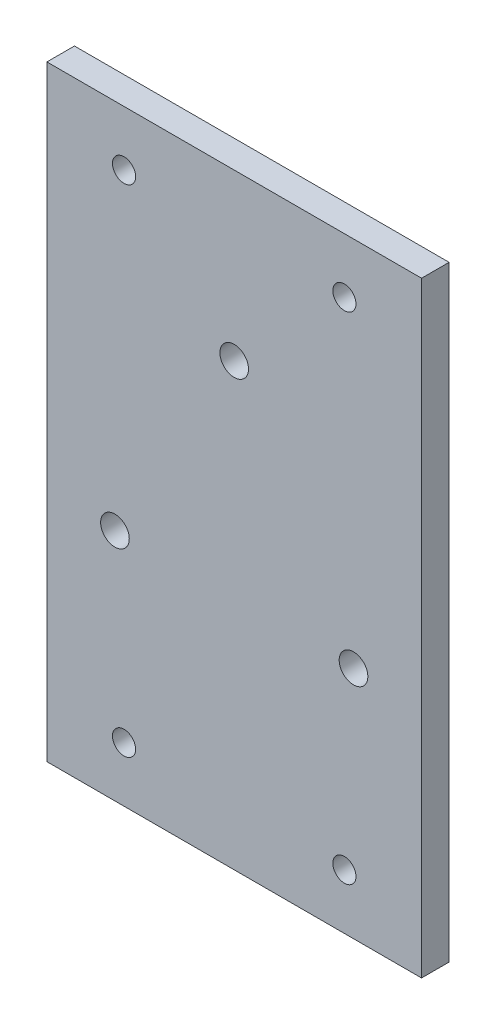
ISO-10303-21;
HEADER;
FILE_DESCRIPTION(('STEP AP214'),'2;1');
FILE_NAME('part.step','',(''),(''),'','','');
FILE_SCHEMA(('AUTOMOTIVE_DESIGN { 1 0 10303 214 1 1 1 1 }'));
ENDSEC;
DATA;
#1=APPLICATION_CONTEXT('core data for automotive mechanical design processes');
#2=APPLICATION_PROTOCOL_DEFINITION('international standard','automotive_design',2000,#1);
#3=PRODUCT_CONTEXT('',#1,'mechanical');
#4=PRODUCT('Part','Part','',(#3));
#5=PRODUCT_RELATED_PRODUCT_CATEGORY('part','',(#4));
#6=PRODUCT_DEFINITION_FORMATION('','',#4);
#7=PRODUCT_DEFINITION_CONTEXT('part definition',#1,'design');
#8=PRODUCT_DEFINITION('design','',#6,#7);
#9=PRODUCT_DEFINITION_SHAPE('','',#8);
#10=(LENGTH_UNIT() NAMED_UNIT(*) SI_UNIT(.MILLI.,.METRE.));
#11=(NAMED_UNIT(*) PLANE_ANGLE_UNIT() SI_UNIT($,.RADIAN.));
#12=(NAMED_UNIT(*) SI_UNIT($,.STERADIAN.) SOLID_ANGLE_UNIT());
#13=UNCERTAINTY_MEASURE_WITH_UNIT(LENGTH_MEASURE(1.E-05),#10,'distance_accuracy_value','');
#14=(GEOMETRIC_REPRESENTATION_CONTEXT(3) GLOBAL_UNCERTAINTY_ASSIGNED_CONTEXT((#13)) GLOBAL_UNIT_ASSIGNED_CONTEXT((#10,
#11,#12)) REPRESENTATION_CONTEXT('',''));
#15=CARTESIAN_POINT('',(0.,0.,0.));
#16=DIRECTION('',(0.,0.,1.));
#17=DIRECTION('',(1.,0.,0.));
#18=AXIS2_PLACEMENT_3D('',#15,#16,#17);
#19=CARTESIAN_POINT('',(0.,0.,5.));
#20=DIRECTION('',(0.,0.,1.));
#21=DIRECTION('',(1.,0.,0.));
#22=AXIS2_PLACEMENT_3D('',#19,#20,#21);
#23=PLANE('',#22);
#24=CARTESIAN_POINT('',(0.,25.,5.));
#25=DIRECTION('',(0.,0.,1.));
#26=DIRECTION('',(1.,0.,0.));
#27=AXIS2_PLACEMENT_3D('',#24,#25,#26);
#28=CIRCLE('',#27,2.6);
#29=CARTESIAN_POINT('',(2.59999999999999,25.,5.));
#30=VERTEX_POINT('',#29);
#31=EDGE_CURVE('E139',#30,#30,#28,.T.);
#32=ORIENTED_EDGE('',*,*,#31,.F.);
#33=EDGE_LOOP('',(#32));
#34=FACE_BOUND('',#33,.T.);
#35=CARTESIAN_POINT('',(-20.,-45.,5.));
#36=DIRECTION('',(0.,0.,1.));
#37=DIRECTION('',(1.,0.,0.));
#38=AXIS2_PLACEMENT_3D('',#35,#36,#37);
#39=CIRCLE('',#38,2.1);
#40=CARTESIAN_POINT('',(-17.9,-45.,5.));
#41=VERTEX_POINT('',#40);
#42=EDGE_CURVE('E127',#41,#41,#39,.T.);
#43=ORIENTED_EDGE('',*,*,#42,.F.);
#44=EDGE_LOOP('',(#43));
#45=FACE_BOUND('',#44,.T.);
#46=CARTESIAN_POINT('',(-20.,45.,5.));
#47=DIRECTION('',(0.,0.,1.));
#48=DIRECTION('',(1.,0.,0.));
#49=AXIS2_PLACEMENT_3D('',#46,#47,#48);
#50=CIRCLE('',#49,2.1);
#51=CARTESIAN_POINT('',(-17.9,45.,5.));
#52=VERTEX_POINT('',#51);
#53=EDGE_CURVE('E115',#52,#52,#50,.T.);
#54=ORIENTED_EDGE('',*,*,#53,.F.);
#55=EDGE_LOOP('',(#54));
#56=FACE_BOUND('',#55,.T.);
#57=DIRECTION('',(0.,1.,0.));
#58=VECTOR('',#57,1.);
#59=CARTESIAN_POINT('',(34.,55.,5.));
#60=LINE('',#59,#58);
#61=CARTESIAN_POINT('',(34.,-55.,5.));
#62=VERTEX_POINT('',#61);
#63=CARTESIAN_POINT('',(34.,55.,5.));
#64=VERTEX_POINT('',#63);
#65=EDGE_CURVE('E85',#62,#64,#60,.T.);
#66=ORIENTED_EDGE('',*,*,#65,.T.);
#67=DIRECTION('',(-1.,0.,0.));
#68=VECTOR('',#67,1.);
#69=CARTESIAN_POINT('',(-34.,55.,5.));
#70=LINE('',#69,#68);
#71=CARTESIAN_POINT('',(-34.,55.,5.));
#72=VERTEX_POINT('',#71);
#73=EDGE_CURVE('E80',#64,#72,#70,.T.);
#74=ORIENTED_EDGE('',*,*,#73,.T.);
#75=DIRECTION('',(0.,-1.,0.));
#76=VECTOR('',#75,1.);
#77=CARTESIAN_POINT('',(-34.,55.,5.));
#78=LINE('',#77,#76);
#79=CARTESIAN_POINT('',(-34.,-55.,5.));
#80=VERTEX_POINT('',#79);
#81=EDGE_CURVE('E83',#72,#80,#78,.T.);
#82=ORIENTED_EDGE('',*,*,#81,.T.);
#83=DIRECTION('',(1.,0.,0.));
#84=VECTOR('',#83,1.);
#85=CARTESIAN_POINT('',(-34.,-55.,5.));
#86=LINE('',#85,#84);
#87=EDGE_CURVE('E50',#80,#62,#86,.T.);
#88=ORIENTED_EDGE('',*,*,#87,.T.);
#89=EDGE_LOOP('',(#66,#74,#82,#88));
#90=FACE_BOUND('',#89,.T.);
#91=CARTESIAN_POINT('',(20.,45.,5.));
#92=DIRECTION('',(0.,0.,1.));
#93=DIRECTION('',(1.,0.,0.));
#94=AXIS2_PLACEMENT_3D('',#91,#92,#93);
#95=CIRCLE('',#94,2.1);
#96=CARTESIAN_POINT('',(22.1,45.,5.));
#97=VERTEX_POINT('',#96);
#98=EDGE_CURVE('E100',#97,#97,#95,.T.);
#99=ORIENTED_EDGE('',*,*,#98,.F.);
#100=EDGE_LOOP('',(#99));
#101=FACE_BOUND('',#100,.T.);
#102=CARTESIAN_POINT('',(20.,-45.,5.));
#103=DIRECTION('',(0.,0.,1.));
#104=DIRECTION('',(1.,0.,0.));
#105=AXIS2_PLACEMENT_3D('',#102,#103,#104);
#106=CIRCLE('',#105,2.1);
#107=CARTESIAN_POINT('',(22.1,-45.,5.));
#108=VERTEX_POINT('',#107);
#109=EDGE_CURVE('E121',#108,#108,#106,.T.);
#110=ORIENTED_EDGE('',*,*,#109,.F.);
#111=EDGE_LOOP('',(#110));
#112=FACE_BOUND('',#111,.T.);
#113=CARTESIAN_POINT('',(21.650635094611,-12.5,5.));
#114=DIRECTION('',(0.,0.,1.));
#115=DIRECTION('',(1.,0.,0.));
#116=AXIS2_PLACEMENT_3D('',#113,#114,#115);
#117=CIRCLE('',#116,2.6);
#118=CARTESIAN_POINT('',(24.250635094611,-12.5,5.));
#119=VERTEX_POINT('',#118);
#120=EDGE_CURVE('E133',#119,#119,#117,.T.);
#121=ORIENTED_EDGE('',*,*,#120,.F.);
#122=EDGE_LOOP('',(#121));
#123=FACE_BOUND('',#122,.T.);
#124=CARTESIAN_POINT('',(-21.650635094611,-12.5,5.));
#125=DIRECTION('',(0.,0.,1.));
#126=DIRECTION('',(1.,0.,0.));
#127=AXIS2_PLACEMENT_3D('',#124,#125,#126);
#128=CIRCLE('',#127,2.6);
#129=CARTESIAN_POINT('',(-19.050635094611,-12.5,5.));
#130=VERTEX_POINT('',#129);
#131=EDGE_CURVE('E145',#130,#130,#128,.T.);
#132=ORIENTED_EDGE('',*,*,#131,.F.);
#133=EDGE_LOOP('',(#132));
#134=FACE_BOUND('',#133,.T.);
#135=ADVANCED_FACE('F33',(#34,#45,#56,#90,#101,#112,#123,#134),#23,.T.);
#136=CARTESIAN_POINT('',(0.,0.,0.));
#137=DIRECTION('',(0.,0.,1.));
#138=DIRECTION('',(1.,0.,0.));
#139=AXIS2_PLACEMENT_3D('',#136,#137,#138);
#140=PLANE('',#139);
#141=DIRECTION('',(0.,1.,0.));
#142=VECTOR('',#141,1.);
#143=CARTESIAN_POINT('',(34.,55.,0.));
#144=LINE('',#143,#142);
#145=CARTESIAN_POINT('',(34.,-55.,0.));
#146=VERTEX_POINT('',#145);
#147=CARTESIAN_POINT('',(34.,55.,0.));
#148=VERTEX_POINT('',#147);
#149=EDGE_CURVE('E97',#146,#148,#144,.T.);
#150=ORIENTED_EDGE('',*,*,#149,.F.);
#151=DIRECTION('',(1.,0.,0.));
#152=VECTOR('',#151,1.);
#153=CARTESIAN_POINT('',(-34.,-55.,0.));
#154=LINE('',#153,#152);
#155=CARTESIAN_POINT('',(-34.,-55.,0.));
#156=VERTEX_POINT('',#155);
#157=EDGE_CURVE('E73',#156,#146,#154,.T.);
#158=ORIENTED_EDGE('',*,*,#157,.F.);
#159=DIRECTION('',(0.,-1.,0.));
#160=VECTOR('',#159,1.);
#161=CARTESIAN_POINT('',(-34.,55.,0.));
#162=LINE('',#161,#160);
#163=CARTESIAN_POINT('',(-34.,55.,0.));
#164=VERTEX_POINT('',#163);
#165=EDGE_CURVE('E67',#164,#156,#162,.T.);
#166=ORIENTED_EDGE('',*,*,#165,.F.);
#167=DIRECTION('',(-1.,0.,0.));
#168=VECTOR('',#167,1.);
#169=CARTESIAN_POINT('',(-34.,55.,0.));
#170=LINE('',#169,#168);
#171=EDGE_CURVE('E89',#148,#164,#170,.T.);
#172=ORIENTED_EDGE('',*,*,#171,.F.);
#173=EDGE_LOOP('',(#150,#158,#166,#172));
#174=FACE_BOUND('',#173,.T.);
#175=CARTESIAN_POINT('',(20.,45.,0.));
#176=DIRECTION('',(0.,0.,1.));
#177=DIRECTION('',(1.,0.,0.));
#178=AXIS2_PLACEMENT_3D('',#175,#176,#177);
#179=CIRCLE('',#178,2.1);
#180=CARTESIAN_POINT('',(22.1,45.,0.));
#181=VERTEX_POINT('',#180);
#182=EDGE_CURVE('E112',#181,#181,#179,.T.);
#183=ORIENTED_EDGE('',*,*,#182,.T.);
#184=EDGE_LOOP('',(#183));
#185=FACE_BOUND('',#184,.T.);
#186=CARTESIAN_POINT('',(-20.,45.,0.));
#187=DIRECTION('',(0.,0.,1.));
#188=DIRECTION('',(1.,0.,0.));
#189=AXIS2_PLACEMENT_3D('',#186,#187,#188);
#190=CIRCLE('',#189,2.1);
#191=CARTESIAN_POINT('',(-17.9,45.,0.));
#192=VERTEX_POINT('',#191);
#193=EDGE_CURVE('E118',#192,#192,#190,.T.);
#194=ORIENTED_EDGE('',*,*,#193,.T.);
#195=EDGE_LOOP('',(#194));
#196=FACE_BOUND('',#195,.T.);
#197=CARTESIAN_POINT('',(20.,-45.,0.));
#198=DIRECTION('',(0.,0.,1.));
#199=DIRECTION('',(1.,0.,0.));
#200=AXIS2_PLACEMENT_3D('',#197,#198,#199);
#201=CIRCLE('',#200,2.1);
#202=CARTESIAN_POINT('',(22.1,-45.,0.));
#203=VERTEX_POINT('',#202);
#204=EDGE_CURVE('E124',#203,#203,#201,.T.);
#205=ORIENTED_EDGE('',*,*,#204,.T.);
#206=EDGE_LOOP('',(#205));
#207=FACE_BOUND('',#206,.T.);
#208=CARTESIAN_POINT('',(-20.,-45.,0.));
#209=DIRECTION('',(0.,0.,1.));
#210=DIRECTION('',(1.,0.,0.));
#211=AXIS2_PLACEMENT_3D('',#208,#209,#210);
#212=CIRCLE('',#211,2.1);
#213=CARTESIAN_POINT('',(-17.9,-45.,0.));
#214=VERTEX_POINT('',#213);
#215=EDGE_CURVE('E130',#214,#214,#212,.T.);
#216=ORIENTED_EDGE('',*,*,#215,.T.);
#217=EDGE_LOOP('',(#216));
#218=FACE_BOUND('',#217,.T.);
#219=CARTESIAN_POINT('',(21.650635094611,-12.5,0.));
#220=DIRECTION('',(0.,0.,1.));
#221=DIRECTION('',(1.,0.,0.));
#222=AXIS2_PLACEMENT_3D('',#219,#220,#221);
#223=CIRCLE('',#222,2.6);
#224=CARTESIAN_POINT('',(24.250635094611,-12.5,0.));
#225=VERTEX_POINT('',#224);
#226=EDGE_CURVE('E136',#225,#225,#223,.T.);
#227=ORIENTED_EDGE('',*,*,#226,.T.);
#228=EDGE_LOOP('',(#227));
#229=FACE_BOUND('',#228,.T.);
#230=CARTESIAN_POINT('',(0.,25.,0.));
#231=DIRECTION('',(0.,0.,1.));
#232=DIRECTION('',(1.,0.,0.));
#233=AXIS2_PLACEMENT_3D('',#230,#231,#232);
#234=CIRCLE('',#233,2.6);
#235=CARTESIAN_POINT('',(2.59999999999999,25.,0.));
#236=VERTEX_POINT('',#235);
#237=EDGE_CURVE('E142',#236,#236,#234,.T.);
#238=ORIENTED_EDGE('',*,*,#237,.T.);
#239=EDGE_LOOP('',(#238));
#240=FACE_BOUND('',#239,.T.);
#241=CARTESIAN_POINT('',(-21.650635094611,-12.5,0.));
#242=DIRECTION('',(0.,0.,1.));
#243=DIRECTION('',(1.,0.,0.));
#244=AXIS2_PLACEMENT_3D('',#241,#242,#243);
#245=CIRCLE('',#244,2.6);
#246=CARTESIAN_POINT('',(-19.050635094611,-12.5,0.));
#247=VERTEX_POINT('',#246);
#248=EDGE_CURVE('E148',#247,#247,#245,.T.);
#249=ORIENTED_EDGE('',*,*,#248,.T.);
#250=EDGE_LOOP('',(#249));
#251=FACE_BOUND('',#250,.T.);
#252=ADVANCED_FACE('F108',(#174,#185,#196,#207,#218,#229,#240,#251),#140,.F.);
#253=CARTESIAN_POINT('',(34.,55.,5.));
#254=DIRECTION('',(-1.,0.,0.));
#255=DIRECTION('',(0.,-1.,0.));
#256=AXIS2_PLACEMENT_3D('',#253,#254,#255);
#257=PLANE('',#256);
#258=ORIENTED_EDGE('',*,*,#149,.T.);
#259=DIRECTION('',(0.,0.,-1.));
#260=VECTOR('',#259,1.);
#261=CARTESIAN_POINT('',(34.,55.,5.));
#262=LINE('',#261,#260);
#263=EDGE_CURVE('E11',#64,#148,#262,.T.);
#264=ORIENTED_EDGE('',*,*,#263,.F.);
#265=ORIENTED_EDGE('',*,*,#65,.F.);
#266=DIRECTION('',(0.,0.,-1.));
#267=VECTOR('',#266,1.);
#268=CARTESIAN_POINT('',(34.,-55.,5.));
#269=LINE('',#268,#267);
#270=EDGE_CURVE('E93',#62,#146,#269,.T.);
#271=ORIENTED_EDGE('',*,*,#270,.T.);
#272=EDGE_LOOP('',(#258,#264,#265,#271));
#273=FACE_BOUND('',#272,.T.);
#274=ADVANCED_FACE('F35',(#273),#257,.F.);
#275=CARTESIAN_POINT('',(-34.,55.,5.));
#276=DIRECTION('',(0.,-1.,0.));
#277=DIRECTION('',(0.,0.,-1.));
#278=AXIS2_PLACEMENT_3D('',#275,#276,#277);
#279=PLANE('',#278);
#280=ORIENTED_EDGE('',*,*,#171,.T.);
#281=DIRECTION('',(0.,0.,-1.));
#282=VECTOR('',#281,1.);
#283=CARTESIAN_POINT('',(-34.,55.,5.));
#284=LINE('',#283,#282);
#285=EDGE_CURVE('E42',#72,#164,#284,.T.);
#286=ORIENTED_EDGE('',*,*,#285,.F.);
#287=ORIENTED_EDGE('',*,*,#73,.F.);
#288=ORIENTED_EDGE('',*,*,#263,.T.);
#289=EDGE_LOOP('',(#280,#286,#287,#288));
#290=FACE_BOUND('',#289,.T.);
#291=ADVANCED_FACE('F88',(#290),#279,.F.);
#292=CARTESIAN_POINT('',(-34.,55.,5.));
#293=DIRECTION('',(1.,0.,0.));
#294=DIRECTION('',(0.,1.,0.));
#295=AXIS2_PLACEMENT_3D('',#292,#293,#294);
#296=PLANE('',#295);
#297=ORIENTED_EDGE('',*,*,#165,.T.);
#298=DIRECTION('',(0.,0.,-1.));
#299=VECTOR('',#298,1.);
#300=CARTESIAN_POINT('',(-34.,-55.,5.));
#301=LINE('',#300,#299);
#302=EDGE_CURVE('E90',#80,#156,#301,.T.);
#303=ORIENTED_EDGE('',*,*,#302,.F.);
#304=ORIENTED_EDGE('',*,*,#81,.F.);
#305=ORIENTED_EDGE('',*,*,#285,.T.);
#306=EDGE_LOOP('',(#297,#303,#304,#305));
#307=FACE_BOUND('',#306,.T.);
#308=ADVANCED_FACE('F91',(#307),#296,.F.);
#309=CARTESIAN_POINT('',(-34.,-55.,5.));
#310=DIRECTION('',(0.,1.,0.));
#311=DIRECTION('',(0.,0.,1.));
#312=AXIS2_PLACEMENT_3D('',#309,#310,#311);
#313=PLANE('',#312);
#314=ORIENTED_EDGE('',*,*,#157,.T.);
#315=ORIENTED_EDGE('',*,*,#270,.F.);
#316=ORIENTED_EDGE('',*,*,#87,.F.);
#317=ORIENTED_EDGE('',*,*,#302,.T.);
#318=EDGE_LOOP('',(#314,#315,#316,#317));
#319=FACE_BOUND('',#318,.T.);
#320=ADVANCED_FACE('F105',(#319),#313,.F.);
#321=CARTESIAN_POINT('',(20.,45.,5.));
#322=DIRECTION('',(0.,0.,-1.));
#323=DIRECTION('',(-1.,0.,0.));
#324=AXIS2_PLACEMENT_3D('',#321,#322,#323);
#325=CYLINDRICAL_SURFACE('',#324,2.1);
#326=ORIENTED_EDGE('',*,*,#98,.T.);
#327=EDGE_LOOP('',(#326));
#328=FACE_BOUND('',#327,.T.);
#329=ORIENTED_EDGE('',*,*,#182,.F.);
#330=EDGE_LOOP('',(#329));
#331=FACE_BOUND('',#330,.T.);
#332=ADVANCED_FACE('F167',(#328,#331),#325,.F.);
#333=CARTESIAN_POINT('',(-20.,45.,5.));
#334=DIRECTION('',(0.,0.,-1.));
#335=DIRECTION('',(-1.,0.,0.));
#336=AXIS2_PLACEMENT_3D('',#333,#334,#335);
#337=CYLINDRICAL_SURFACE('',#336,2.1);
#338=ORIENTED_EDGE('',*,*,#53,.T.);
#339=EDGE_LOOP('',(#338));
#340=FACE_BOUND('',#339,.T.);
#341=ORIENTED_EDGE('',*,*,#193,.F.);
#342=EDGE_LOOP('',(#341));
#343=FACE_BOUND('',#342,.T.);
#344=ADVANCED_FACE('F213',(#340,#343),#337,.F.);
#345=CARTESIAN_POINT('',(20.,-45.,5.));
#346=DIRECTION('',(0.,0.,-1.));
#347=DIRECTION('',(-1.,0.,0.));
#348=AXIS2_PLACEMENT_3D('',#345,#346,#347);
#349=CYLINDRICAL_SURFACE('',#348,2.1);
#350=ORIENTED_EDGE('',*,*,#109,.T.);
#351=EDGE_LOOP('',(#350));
#352=FACE_BOUND('',#351,.T.);
#353=ORIENTED_EDGE('',*,*,#204,.F.);
#354=EDGE_LOOP('',(#353));
#355=FACE_BOUND('',#354,.T.);
#356=ADVANCED_FACE('F221',(#352,#355),#349,.F.);
#357=CARTESIAN_POINT('',(-20.,-45.,5.));
#358=DIRECTION('',(0.,0.,-1.));
#359=DIRECTION('',(-1.,0.,0.));
#360=AXIS2_PLACEMENT_3D('',#357,#358,#359);
#361=CYLINDRICAL_SURFACE('',#360,2.1);
#362=ORIENTED_EDGE('',*,*,#42,.T.);
#363=EDGE_LOOP('',(#362));
#364=FACE_BOUND('',#363,.T.);
#365=ORIENTED_EDGE('',*,*,#215,.F.);
#366=EDGE_LOOP('',(#365));
#367=FACE_BOUND('',#366,.T.);
#368=ADVANCED_FACE('F229',(#364,#367),#361,.F.);
#369=CARTESIAN_POINT('',(21.650635094611,-12.5,5.));
#370=DIRECTION('',(0.,0.,-1.));
#371=DIRECTION('',(-1.,0.,0.));
#372=AXIS2_PLACEMENT_3D('',#369,#370,#371);
#373=CYLINDRICAL_SURFACE('',#372,2.6);
#374=ORIENTED_EDGE('',*,*,#120,.T.);
#375=EDGE_LOOP('',(#374));
#376=FACE_BOUND('',#375,.T.);
#377=ORIENTED_EDGE('',*,*,#226,.F.);
#378=EDGE_LOOP('',(#377));
#379=FACE_BOUND('',#378,.T.);
#380=ADVANCED_FACE('F238',(#376,#379),#373,.F.);
#381=CARTESIAN_POINT('',(0.,25.,5.));
#382=DIRECTION('',(0.,0.,-1.));
#383=DIRECTION('',(-1.,0.,0.));
#384=AXIS2_PLACEMENT_3D('',#381,#382,#383);
#385=CYLINDRICAL_SURFACE('',#384,2.6);
#386=ORIENTED_EDGE('',*,*,#31,.T.);
#387=EDGE_LOOP('',(#386));
#388=FACE_BOUND('',#387,.T.);
#389=ORIENTED_EDGE('',*,*,#237,.F.);
#390=EDGE_LOOP('',(#389));
#391=FACE_BOUND('',#390,.T.);
#392=ADVANCED_FACE('F247',(#388,#391),#385,.F.);
#393=CARTESIAN_POINT('',(-21.650635094611,-12.5,5.));
#394=DIRECTION('',(0.,0.,-1.));
#395=DIRECTION('',(-1.,0.,0.));
#396=AXIS2_PLACEMENT_3D('',#393,#394,#395);
#397=CYLINDRICAL_SURFACE('',#396,2.6);
#398=ORIENTED_EDGE('',*,*,#131,.T.);
#399=EDGE_LOOP('',(#398));
#400=FACE_BOUND('',#399,.T.);
#401=ORIENTED_EDGE('',*,*,#248,.F.);
#402=EDGE_LOOP('',(#401));
#403=FACE_BOUND('',#402,.T.);
#404=ADVANCED_FACE('F154',(#400,#403),#397,.F.);
#405=CLOSED_SHELL('',(#135,#252,#274,#291,#308,#320,#332,#344,#356,#368,#380,#392,#404));
#406=MANIFOLD_SOLID_BREP('B2',#405);
#407=ADVANCED_BREP_SHAPE_REPRESENTATION('',(#18,#406),#14);
#408=SHAPE_DEFINITION_REPRESENTATION(#9,#407);
ENDSEC;
END-ISO-10303-21;
